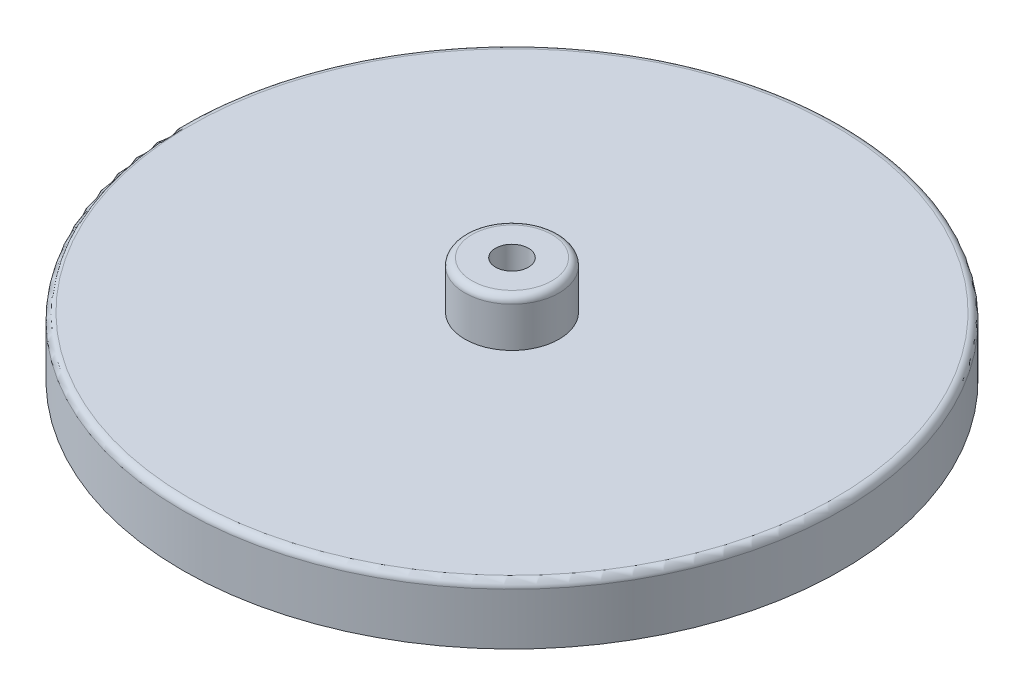
ISO-10303-21;
HEADER;
FILE_DESCRIPTION(('STEP AP214'),'2;1');
FILE_NAME('part.step','',(''),(''),'','','');
FILE_SCHEMA(('AUTOMOTIVE_DESIGN { 1 0 10303 214 1 1 1 1 }'));
ENDSEC;
DATA;
#1=APPLICATION_CONTEXT('core data for automotive mechanical design processes');
#2=APPLICATION_PROTOCOL_DEFINITION('international standard','automotive_design',2000,#1);
#3=PRODUCT_CONTEXT('',#1,'mechanical');
#4=PRODUCT('Part','Part','',(#3));
#5=PRODUCT_RELATED_PRODUCT_CATEGORY('part','',(#4));
#6=PRODUCT_DEFINITION_FORMATION('','',#4);
#7=PRODUCT_DEFINITION_CONTEXT('part definition',#1,'design');
#8=PRODUCT_DEFINITION('design','',#6,#7);
#9=PRODUCT_DEFINITION_SHAPE('','',#8);
#10=(LENGTH_UNIT() NAMED_UNIT(*) SI_UNIT(.MILLI.,.METRE.));
#11=(NAMED_UNIT(*) PLANE_ANGLE_UNIT() SI_UNIT($,.RADIAN.));
#12=(NAMED_UNIT(*) SI_UNIT($,.STERADIAN.) SOLID_ANGLE_UNIT());
#13=UNCERTAINTY_MEASURE_WITH_UNIT(LENGTH_MEASURE(1.E-05),#10,'distance_accuracy_value','');
#14=(GEOMETRIC_REPRESENTATION_CONTEXT(3) GLOBAL_UNCERTAINTY_ASSIGNED_CONTEXT((#13)) GLOBAL_UNIT_ASSIGNED_CONTEXT((#10,
#11,#12)) REPRESENTATION_CONTEXT('',''));
#15=CARTESIAN_POINT('',(0.,0.,0.));
#16=DIRECTION('',(0.,0.,1.));
#17=DIRECTION('',(1.,0.,0.));
#18=AXIS2_PLACEMENT_3D('',#15,#16,#17);
#19=CARTESIAN_POINT('',(0.,0.,0.));
#20=DIRECTION('',(0.,1.,0.));
#21=DIRECTION('',(0.,0.,1.));
#22=AXIS2_PLACEMENT_3D('',#19,#20,#21);
#23=CYLINDRICAL_SURFACE('',#22,1.778);
#24=CARTESIAN_POINT('',(0.,11.43,0.));
#25=DIRECTION('',(0.,1.,0.));
#26=DIRECTION('',(0.,0.,1.));
#27=AXIS2_PLACEMENT_3D('',#24,#25,#26);
#28=CIRCLE('',#27,1.778);
#29=CARTESIAN_POINT('',(0.,11.43,1.778));
#30=VERTEX_POINT('',#29);
#31=EDGE_CURVE('E54',#30,#30,#28,.T.);
#32=ORIENTED_EDGE('',*,*,#31,.T.);
#33=EDGE_LOOP('',(#32));
#34=FACE_BOUND('',#33,.T.);
#35=CARTESIAN_POINT('',(0.,2.54,0.));
#36=DIRECTION('',(0.,-1.,0.));
#37=DIRECTION('',(0.,0.,-1.));
#38=AXIS2_PLACEMENT_3D('',#35,#36,#37);
#39=CIRCLE('',#38,1.778);
#40=CARTESIAN_POINT('',(0.,2.54,-1.778));
#41=VERTEX_POINT('',#40);
#42=EDGE_CURVE('E51',#41,#41,#39,.F.);
#43=ORIENTED_EDGE('',*,*,#42,.F.);
#44=EDGE_LOOP('',(#43));
#45=FACE_BOUND('',#44,.T.);
#46=ADVANCED_FACE('F30',(#34,#45),#23,.F.);
#47=CARTESIAN_POINT('',(0.,6.35,0.));
#48=DIRECTION('',(0.,1.,0.));
#49=DIRECTION('',(0.,0.,1.));
#50=AXIS2_PLACEMENT_3D('',#47,#48,#49);
#51=PLANE('',#50);
#52=CARTESIAN_POINT('',(0.,6.35,0.));
#53=DIRECTION('',(0.,1.,0.));
#54=DIRECTION('',(0.,0.,1.));
#55=AXIS2_PLACEMENT_3D('',#52,#53,#54);
#56=CIRCLE('',#55,34.798);
#57=CARTESIAN_POINT('',(0.,6.35,34.798));
#58=VERTEX_POINT('',#57);
#59=EDGE_CURVE('E37',#58,#58,#56,.T.);
#60=ORIENTED_EDGE('',*,*,#59,.T.);
#61=EDGE_LOOP('',(#60));
#62=FACE_BOUND('',#61,.T.);
#63=CARTESIAN_POINT('',(0.,6.35,0.));
#64=DIRECTION('',(0.,1.,0.));
#65=DIRECTION('',(0.,0.,1.));
#66=AXIS2_PLACEMENT_3D('',#63,#64,#65);
#67=CIRCLE('',#66,5.08);
#68=CARTESIAN_POINT('',(0.,6.35,5.08));
#69=VERTEX_POINT('',#68);
#70=EDGE_CURVE('E58',#69,#69,#67,.T.);
#71=ORIENTED_EDGE('',*,*,#70,.F.);
#72=EDGE_LOOP('',(#71));
#73=FACE_BOUND('',#72,.T.);
#74=ADVANCED_FACE('F88',(#62,#73),#51,.T.);
#75=CARTESIAN_POINT('',(0.,6.35,0.));
#76=DIRECTION('',(0.,-1.,0.));
#77=DIRECTION('',(0.,0.,-1.));
#78=AXIS2_PLACEMENT_3D('',#75,#76,#77);
#79=CYLINDRICAL_SURFACE('',#78,35.56);
#80=CARTESIAN_POINT('',(0.,5.588,0.));
#81=DIRECTION('',(0.,1.,0.));
#82=DIRECTION('',(0.,0.,1.));
#83=AXIS2_PLACEMENT_3D('',#80,#81,#82);
#84=CIRCLE('',#83,35.56);
#85=CARTESIAN_POINT('',(0.,5.588,35.56));
#86=VERTEX_POINT('',#85);
#87=EDGE_CURVE('E10',#86,#86,#84,.F.);
#88=ORIENTED_EDGE('',*,*,#87,.T.);
#89=EDGE_LOOP('',(#88));
#90=FACE_BOUND('',#89,.T.);
#91=CARTESIAN_POINT('',(0.,0.,0.));
#92=DIRECTION('',(0.,1.,0.));
#93=DIRECTION('',(0.,0.,1.));
#94=AXIS2_PLACEMENT_3D('',#91,#92,#93);
#95=CIRCLE('',#94,35.56);
#96=CARTESIAN_POINT('',(0.,0.,35.56));
#97=VERTEX_POINT('',#96);
#98=EDGE_CURVE('E50',#97,#97,#95,.T.);
#99=ORIENTED_EDGE('',*,*,#98,.T.);
#100=EDGE_LOOP('',(#99));
#101=FACE_BOUND('',#100,.T.);
#102=ADVANCED_FACE('F83',(#90,#101),#79,.T.);
#103=CARTESIAN_POINT('',(0.,0.,0.));
#104=DIRECTION('',(0.,1.,0.));
#105=DIRECTION('',(0.,0.,1.));
#106=AXIS2_PLACEMENT_3D('',#103,#104,#105);
#107=PLANE('',#106);
#108=CARTESIAN_POINT('',(0.,0.,0.));
#109=DIRECTION('',(0.,-1.,0.));
#110=DIRECTION('',(0.,0.,-1.));
#111=AXIS2_PLACEMENT_3D('',#108,#109,#110);
#112=CIRCLE('',#111,3.556);
#113=CARTESIAN_POINT('',(0.,0.,-3.556));
#114=VERTEX_POINT('',#113);
#115=EDGE_CURVE('E63',#114,#114,#112,.T.);
#116=ORIENTED_EDGE('',*,*,#115,.F.);
#117=EDGE_LOOP('',(#116));
#118=FACE_BOUND('',#117,.T.);
#119=ORIENTED_EDGE('',*,*,#98,.F.);
#120=EDGE_LOOP('',(#119));
#121=FACE_BOUND('',#120,.T.);
#122=ADVANCED_FACE('F79',(#118,#121),#107,.F.);
#123=CARTESIAN_POINT('',(0.,11.43,0.));
#124=DIRECTION('',(0.,-1.,0.));
#125=DIRECTION('',(0.,0.,-1.));
#126=AXIS2_PLACEMENT_3D('',#123,#124,#125);
#127=CYLINDRICAL_SURFACE('',#126,5.08);
#128=CARTESIAN_POINT('',(0.,10.668,0.));
#129=DIRECTION('',(0.,1.,0.));
#130=DIRECTION('',(0.,0.,1.));
#131=AXIS2_PLACEMENT_3D('',#128,#129,#130);
#132=CIRCLE('',#131,5.08);
#133=CARTESIAN_POINT('',(0.,10.668,5.08));
#134=VERTEX_POINT('',#133);
#135=EDGE_CURVE('E41',#134,#134,#132,.F.);
#136=ORIENTED_EDGE('',*,*,#135,.T.);
#137=EDGE_LOOP('',(#136));
#138=FACE_BOUND('',#137,.T.);
#139=ORIENTED_EDGE('',*,*,#70,.T.);
#140=EDGE_LOOP('',(#139));
#141=FACE_BOUND('',#140,.T.);
#142=ADVANCED_FACE('F82',(#138,#141),#127,.T.);
#143=CARTESIAN_POINT('',(0.,11.43,0.));
#144=DIRECTION('',(0.,1.,0.));
#145=DIRECTION('',(0.,0.,1.));
#146=AXIS2_PLACEMENT_3D('',#143,#144,#145);
#147=PLANE('',#146);
#148=CARTESIAN_POINT('',(0.,11.43,0.));
#149=DIRECTION('',(0.,1.,0.));
#150=DIRECTION('',(0.,0.,1.));
#151=AXIS2_PLACEMENT_3D('',#148,#149,#150);
#152=CIRCLE('',#151,4.318);
#153=CARTESIAN_POINT('',(0.,11.43,4.318));
#154=VERTEX_POINT('',#153);
#155=EDGE_CURVE('E45',#154,#154,#152,.T.);
#156=ORIENTED_EDGE('',*,*,#155,.T.);
#157=EDGE_LOOP('',(#156));
#158=FACE_BOUND('',#157,.T.);
#159=ORIENTED_EDGE('',*,*,#31,.F.);
#160=EDGE_LOOP('',(#159));
#161=FACE_BOUND('',#160,.T.);
#162=ADVANCED_FACE('F102',(#158,#161),#147,.T.);
#163=CARTESIAN_POINT('',(0.,2.54,0.));
#164=DIRECTION('',(0.,-1.,0.));
#165=DIRECTION('',(0.,0.,-1.));
#166=AXIS2_PLACEMENT_3D('',#163,#164,#165);
#167=PLANE('',#166);
#168=CARTESIAN_POINT('',(0.,2.54,0.));
#169=DIRECTION('',(0.,-1.,0.));
#170=DIRECTION('',(0.,0.,-1.));
#171=AXIS2_PLACEMENT_3D('',#168,#169,#170);
#172=CIRCLE('',#171,3.556);
#173=CARTESIAN_POINT('',(0.,2.54,-3.556));
#174=VERTEX_POINT('',#173);
#175=EDGE_CURVE('E55',#174,#174,#172,.T.);
#176=ORIENTED_EDGE('',*,*,#175,.T.);
#177=EDGE_LOOP('',(#176));
#178=FACE_BOUND('',#177,.T.);
#179=ORIENTED_EDGE('',*,*,#42,.T.);
#180=EDGE_LOOP('',(#179));
#181=FACE_BOUND('',#180,.T.);
#182=ADVANCED_FACE('F69',(#178,#181),#167,.T.);
#183=CARTESIAN_POINT('',(0.,2.54,0.));
#184=DIRECTION('',(0.,-1.,0.));
#185=DIRECTION('',(0.,0.,-1.));
#186=AXIS2_PLACEMENT_3D('',#183,#184,#185);
#187=CYLINDRICAL_SURFACE('',#186,3.556);
#188=ORIENTED_EDGE('',*,*,#175,.F.);
#189=EDGE_LOOP('',(#188));
#190=FACE_BOUND('',#189,.T.);
#191=ORIENTED_EDGE('',*,*,#115,.T.);
#192=EDGE_LOOP('',(#191));
#193=FACE_BOUND('',#192,.T.);
#194=ADVANCED_FACE('F72',(#190,#193),#187,.F.);
#195=CARTESIAN_POINT('',(0.,10.668,0.));
#196=DIRECTION('',(0.,1.,0.));
#197=DIRECTION('',(0.,0.,1.));
#198=AXIS2_PLACEMENT_3D('',#195,#196,#197);
#199=TOROIDAL_SURFACE('',#198,4.318,0.762);
#200=ORIENTED_EDGE('',*,*,#135,.F.);
#201=EDGE_LOOP('',(#200));
#202=FACE_BOUND('',#201,.T.);
#203=ORIENTED_EDGE('',*,*,#155,.F.);
#204=EDGE_LOOP('',(#203));
#205=FACE_BOUND('',#204,.T.);
#206=ADVANCED_FACE('F75',(#202,#205),#199,.T.);
#207=CARTESIAN_POINT('',(0.,5.588,0.));
#208=DIRECTION('',(0.,1.,0.));
#209=DIRECTION('',(0.,0.,1.));
#210=AXIS2_PLACEMENT_3D('',#207,#208,#209);
#211=TOROIDAL_SURFACE('',#210,34.798,0.762);
#212=ORIENTED_EDGE('',*,*,#87,.F.);
#213=EDGE_LOOP('',(#212));
#214=FACE_BOUND('',#213,.T.);
#215=ORIENTED_EDGE('',*,*,#59,.F.);
#216=EDGE_LOOP('',(#215));
#217=FACE_BOUND('',#216,.T.);
#218=ADVANCED_FACE('F32',(#214,#217),#211,.T.);
#219=CLOSED_SHELL('',(#46,#74,#102,#122,#142,#162,#182,#194,#206,#218));
#220=MANIFOLD_SOLID_BREP('B2',#219);
#221=ADVANCED_BREP_SHAPE_REPRESENTATION('',(#18,#220),#14);
#222=SHAPE_DEFINITION_REPRESENTATION(#9,#221);
ENDSEC;
END-ISO-10303-21;
